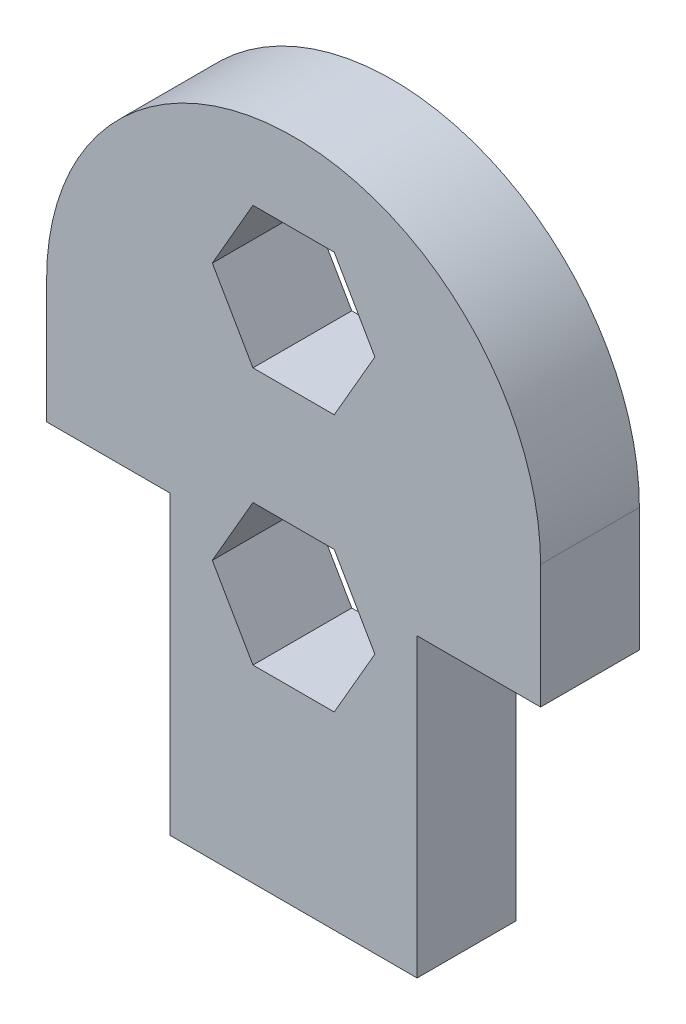
ISO-10303-21;
HEADER;
FILE_DESCRIPTION(('STEP AP214'),'2;1');
FILE_NAME('part.step','',(''),(''),'','','');
FILE_SCHEMA(('AUTOMOTIVE_DESIGN { 1 0 10303 214 1 1 1 1 }'));
ENDSEC;
DATA;
#1=APPLICATION_CONTEXT('core data for automotive mechanical design processes');
#2=APPLICATION_PROTOCOL_DEFINITION('international standard','automotive_design',2000,#1);
#3=PRODUCT_CONTEXT('',#1,'mechanical');
#4=PRODUCT('Part','Part','',(#3));
#5=PRODUCT_RELATED_PRODUCT_CATEGORY('part','',(#4));
#6=PRODUCT_DEFINITION_FORMATION('','',#4);
#7=PRODUCT_DEFINITION_CONTEXT('part definition',#1,'design');
#8=PRODUCT_DEFINITION('design','',#6,#7);
#9=PRODUCT_DEFINITION_SHAPE('','',#8);
#10=(LENGTH_UNIT() NAMED_UNIT(*) SI_UNIT(.MILLI.,.METRE.));
#11=(NAMED_UNIT(*) PLANE_ANGLE_UNIT() SI_UNIT($,.RADIAN.));
#12=(NAMED_UNIT(*) SI_UNIT($,.STERADIAN.) SOLID_ANGLE_UNIT());
#13=UNCERTAINTY_MEASURE_WITH_UNIT(LENGTH_MEASURE(1.E-05),#10,'distance_accuracy_value','');
#14=(GEOMETRIC_REPRESENTATION_CONTEXT(3) GLOBAL_UNCERTAINTY_ASSIGNED_CONTEXT((#13)) GLOBAL_UNIT_ASSIGNED_CONTEXT((#10,
#11,#12)) REPRESENTATION_CONTEXT('',''));
#15=CARTESIAN_POINT('',(0.,0.,0.));
#16=DIRECTION('',(0.,0.,1.));
#17=DIRECTION('',(1.,0.,0.));
#18=AXIS2_PLACEMENT_3D('',#15,#16,#17);
#19=CARTESIAN_POINT('',(5.,17.,4.));
#20=DIRECTION('',(0.,0.,1.));
#21=DIRECTION('',(1.,0.,0.));
#22=AXIS2_PLACEMENT_3D('',#19,#20,#21);
#23=PLANE('',#22);
#24=DIRECTION('',(0.,1.,0.));
#25=VECTOR('',#24,1.);
#26=CARTESIAN_POINT('',(10.,0.,4.));
#27=LINE('',#26,#25);
#28=CARTESIAN_POINT('',(10.,0.,4.));
#29=VERTEX_POINT('',#28);
#30=CARTESIAN_POINT('',(10.,12.,4.));
#31=VERTEX_POINT('',#30);
#32=EDGE_CURVE('E274',#29,#31,#27,.T.);
#33=ORIENTED_EDGE('',*,*,#32,.T.);
#34=DIRECTION('',(1.,0.,0.));
#35=VECTOR('',#34,1.);
#36=CARTESIAN_POINT('',(10.,12.,4.));
#37=LINE('',#36,#35);
#38=CARTESIAN_POINT('',(15.,12.,4.));
#39=VERTEX_POINT('',#38);
#40=EDGE_CURVE('E276',#31,#39,#37,.T.);
#41=ORIENTED_EDGE('',*,*,#40,.T.);
#42=DIRECTION('',(0.,1.,0.));
#43=VECTOR('',#42,1.);
#44=CARTESIAN_POINT('',(15.,12.,4.));
#45=LINE('',#44,#43);
#46=CARTESIAN_POINT('',(15.,17.,4.));
#47=VERTEX_POINT('',#46);
#48=EDGE_CURVE('E278',#39,#47,#45,.T.);
#49=ORIENTED_EDGE('',*,*,#48,.T.);
#50=CARTESIAN_POINT('',(5.,17.,4.));
#51=DIRECTION('',(0.,0.,1.));
#52=DIRECTION('',(1.,0.,0.));
#53=AXIS2_PLACEMENT_3D('',#50,#51,#52);
#54=CIRCLE('',#53,10.);
#55=CARTESIAN_POINT('',(-5.,17.,4.));
#56=VERTEX_POINT('',#55);
#57=EDGE_CURVE('E280',#47,#56,#54,.T.);
#58=ORIENTED_EDGE('',*,*,#57,.T.);
#59=DIRECTION('',(0.,-1.,0.));
#60=VECTOR('',#59,1.);
#61=CARTESIAN_POINT('',(-5.,12.,4.));
#62=LINE('',#61,#60);
#63=CARTESIAN_POINT('',(-5.,12.,4.));
#64=VERTEX_POINT('',#63);
#65=EDGE_CURVE('E282',#56,#64,#62,.T.);
#66=ORIENTED_EDGE('',*,*,#65,.T.);
#67=DIRECTION('',(1.,0.,0.));
#68=VECTOR('',#67,1.);
#69=CARTESIAN_POINT('',(0.,12.,4.));
#70=LINE('',#69,#68);
#71=CARTESIAN_POINT('',(0.,12.,4.));
#72=VERTEX_POINT('',#71);
#73=EDGE_CURVE('E284',#64,#72,#70,.T.);
#74=ORIENTED_EDGE('',*,*,#73,.T.);
#75=DIRECTION('',(0.,-1.,0.));
#76=VECTOR('',#75,1.);
#77=CARTESIAN_POINT('',(0.,0.,4.));
#78=LINE('',#77,#76);
#79=CARTESIAN_POINT('',(0.,0.,4.));
#80=VERTEX_POINT('',#79);
#81=EDGE_CURVE('E268',#72,#80,#78,.T.);
#82=ORIENTED_EDGE('',*,*,#81,.T.);
#83=DIRECTION('',(1.,0.,0.));
#84=VECTOR('',#83,1.);
#85=CARTESIAN_POINT('',(0.,0.,4.));
#86=LINE('',#85,#84);
#87=EDGE_CURVE('E271',#80,#29,#86,.T.);
#88=ORIENTED_EDGE('',*,*,#87,.T.);
#89=EDGE_LOOP('',(#33,#41,#49,#58,#66,#74,#82,#88));
#90=FACE_BOUND('',#89,.T.);
#91=DIRECTION('',(-0.5,-0.866025403784439,0.));
#92=VECTOR('',#91,1.);
#93=CARTESIAN_POINT('',(3.35455173280957,23.7711723588727,4.));
#94=LINE('',#93,#92);
#95=CARTESIAN_POINT('',(3.35455173280957,23.7711723588727,4.));
#96=VERTEX_POINT('',#95);
#97=CARTESIAN_POINT('',(1.70910346561913,20.9211723588727,4.));
#98=VERTEX_POINT('',#97);
#99=EDGE_CURVE('E225',#96,#98,#94,.T.);
#100=ORIENTED_EDGE('',*,*,#99,.F.);
#101=DIRECTION('',(-1.,0.,0.));
#102=VECTOR('',#101,1.);
#103=CARTESIAN_POINT('',(6.64544826719043,23.7711723588727,4.));
#104=LINE('',#103,#102);
#105=CARTESIAN_POINT('',(6.64544826719043,23.7711723588727,4.));
#106=VERTEX_POINT('',#105);
#107=EDGE_CURVE('E223',#106,#96,#104,.T.);
#108=ORIENTED_EDGE('',*,*,#107,.F.);
#109=DIRECTION('',(-0.5,0.866025403784438,0.));
#110=VECTOR('',#109,1.);
#111=CARTESIAN_POINT('',(8.29089653438087,20.9211723588727,4.));
#112=LINE('',#111,#110);
#113=CARTESIAN_POINT('',(8.29089653438087,20.9211723588727,4.));
#114=VERTEX_POINT('',#113);
#115=EDGE_CURVE('E235',#114,#106,#112,.T.);
#116=ORIENTED_EDGE('',*,*,#115,.F.);
#117=DIRECTION('',(0.499999999999999,0.866025403784439,0.));
#118=VECTOR('',#117,1.);
#119=CARTESIAN_POINT('',(6.64544826719044,18.0711723588727,4.));
#120=LINE('',#119,#118);
#121=CARTESIAN_POINT('',(6.64544826719044,18.0711723588727,4.));
#122=VERTEX_POINT('',#121);
#123=EDGE_CURVE('E232',#122,#114,#120,.T.);
#124=ORIENTED_EDGE('',*,*,#123,.F.);
#125=DIRECTION('',(1.,0.,0.));
#126=VECTOR('',#125,1.);
#127=CARTESIAN_POINT('',(3.35455173280957,18.0711723588727,4.));
#128=LINE('',#127,#126);
#129=CARTESIAN_POINT('',(3.35455173280957,18.0711723588727,4.));
#130=VERTEX_POINT('',#129);
#131=EDGE_CURVE('E230',#130,#122,#128,.T.);
#132=ORIENTED_EDGE('',*,*,#131,.F.);
#133=DIRECTION('',(0.499999999999999,-0.866025403784439,0.));
#134=VECTOR('',#133,1.);
#135=CARTESIAN_POINT('',(1.70910346561913,20.9211723588727,4.));
#136=LINE('',#135,#134);
#137=EDGE_CURVE('E228',#98,#130,#136,.T.);
#138=ORIENTED_EDGE('',*,*,#137,.F.);
#139=EDGE_LOOP('',(#100,#108,#116,#124,#132,#138));
#140=FACE_BOUND('',#139,.T.);
#141=DIRECTION('',(-0.5,-0.866025403784439,0.));
#142=VECTOR('',#141,1.);
#143=CARTESIAN_POINT('',(3.35455173280957,13.35,4.));
#144=LINE('',#143,#142);
#145=CARTESIAN_POINT('',(3.35455173280957,13.35,4.));
#146=VERTEX_POINT('',#145);
#147=CARTESIAN_POINT('',(1.70910346561913,10.5,4.));
#148=VERTEX_POINT('',#147);
#149=EDGE_CURVE('E180',#146,#148,#144,.T.);
#150=ORIENTED_EDGE('',*,*,#149,.F.);
#151=DIRECTION('',(-1.,0.,0.));
#152=VECTOR('',#151,1.);
#153=CARTESIAN_POINT('',(6.64544826719043,13.35,4.));
#154=LINE('',#153,#152);
#155=CARTESIAN_POINT('',(6.64544826719043,13.35,4.));
#156=VERTEX_POINT('',#155);
#157=EDGE_CURVE('E172',#156,#146,#154,.T.);
#158=ORIENTED_EDGE('',*,*,#157,.F.);
#159=DIRECTION('',(-0.5,0.866025403784439,0.));
#160=VECTOR('',#159,1.);
#161=CARTESIAN_POINT('',(8.29089653438087,10.5,4.));
#162=LINE('',#161,#160);
#163=CARTESIAN_POINT('',(8.29089653438087,10.5,4.));
#164=VERTEX_POINT('',#163);
#165=EDGE_CURVE('E201',#164,#156,#162,.T.);
#166=ORIENTED_EDGE('',*,*,#165,.F.);
#167=DIRECTION('',(0.5,0.866025403784439,0.));
#168=VECTOR('',#167,1.);
#169=CARTESIAN_POINT('',(6.64544826719043,7.65,4.));
#170=LINE('',#169,#168);
#171=CARTESIAN_POINT('',(6.64544826719043,7.65,4.));
#172=VERTEX_POINT('',#171);
#173=EDGE_CURVE('E199',#172,#164,#170,.T.);
#174=ORIENTED_EDGE('',*,*,#173,.F.);
#175=DIRECTION('',(1.,0.,0.));
#176=VECTOR('',#175,1.);
#177=CARTESIAN_POINT('',(3.35455173280956,7.65,4.));
#178=LINE('',#177,#176);
#179=CARTESIAN_POINT('',(3.35455173280956,7.65,4.));
#180=VERTEX_POINT('',#179);
#181=EDGE_CURVE('E195',#180,#172,#178,.T.);
#182=ORIENTED_EDGE('',*,*,#181,.F.);
#183=DIRECTION('',(0.499999999999999,-0.866025403784439,0.));
#184=VECTOR('',#183,1.);
#185=CARTESIAN_POINT('',(1.70910346561913,10.5,4.));
#186=LINE('',#185,#184);
#187=EDGE_CURVE('E193',#148,#180,#186,.T.);
#188=ORIENTED_EDGE('',*,*,#187,.F.);
#189=EDGE_LOOP('',(#150,#158,#166,#174,#182,#188));
#190=FACE_BOUND('',#189,.T.);
#191=ADVANCED_FACE('F35',(#90,#140,#190),#23,.T.);
#192=CARTESIAN_POINT('',(5.,17.,0.));
#193=DIRECTION('',(0.,0.,1.));
#194=DIRECTION('',(1.,0.,0.));
#195=AXIS2_PLACEMENT_3D('',#192,#193,#194);
#196=PLANE('',#195);
#197=DIRECTION('',(-1.,0.,0.));
#198=VECTOR('',#197,1.);
#199=CARTESIAN_POINT('',(6.64544826719043,23.7711723588727,0.));
#200=LINE('',#199,#198);
#201=CARTESIAN_POINT('',(6.64544826719043,23.7711723588727,0.));
#202=VERTEX_POINT('',#201);
#203=CARTESIAN_POINT('',(3.35455173280957,23.7711723588727,0.));
#204=VERTEX_POINT('',#203);
#205=EDGE_CURVE('E188',#202,#204,#200,.T.);
#206=ORIENTED_EDGE('',*,*,#205,.T.);
#207=DIRECTION('',(-0.5,-0.866025403784439,0.));
#208=VECTOR('',#207,1.);
#209=CARTESIAN_POINT('',(3.35455173280957,23.7711723588727,0.));
#210=LINE('',#209,#208);
#211=CARTESIAN_POINT('',(1.70910346561913,20.9211723588727,0.));
#212=VERTEX_POINT('',#211);
#213=EDGE_CURVE('E240',#204,#212,#210,.T.);
#214=ORIENTED_EDGE('',*,*,#213,.T.);
#215=DIRECTION('',(0.499999999999999,-0.866025403784439,0.));
#216=VECTOR('',#215,1.);
#217=CARTESIAN_POINT('',(1.70910346561913,20.9211723588727,0.));
#218=LINE('',#217,#216);
#219=CARTESIAN_POINT('',(3.35455173280957,18.0711723588727,0.));
#220=VERTEX_POINT('',#219);
#221=EDGE_CURVE('E243',#212,#220,#218,.T.);
#222=ORIENTED_EDGE('',*,*,#221,.T.);
#223=DIRECTION('',(1.,0.,0.));
#224=VECTOR('',#223,1.);
#225=CARTESIAN_POINT('',(3.35455173280957,18.0711723588727,0.));
#226=LINE('',#225,#224);
#227=CARTESIAN_POINT('',(6.64544826719044,18.0711723588727,0.));
#228=VERTEX_POINT('',#227);
#229=EDGE_CURVE('E246',#220,#228,#226,.T.);
#230=ORIENTED_EDGE('',*,*,#229,.T.);
#231=DIRECTION('',(0.499999999999999,0.866025403784439,0.));
#232=VECTOR('',#231,1.);
#233=CARTESIAN_POINT('',(6.64544826719044,18.0711723588727,0.));
#234=LINE('',#233,#232);
#235=CARTESIAN_POINT('',(8.29089653438087,20.9211723588727,0.));
#236=VERTEX_POINT('',#235);
#237=EDGE_CURVE('E249',#228,#236,#234,.T.);
#238=ORIENTED_EDGE('',*,*,#237,.T.);
#239=DIRECTION('',(-0.5,0.866025403784438,0.));
#240=VECTOR('',#239,1.);
#241=CARTESIAN_POINT('',(8.29089653438087,20.9211723588727,0.));
#242=LINE('',#241,#240);
#243=EDGE_CURVE('E226',#236,#202,#242,.T.);
#244=ORIENTED_EDGE('',*,*,#243,.T.);
#245=EDGE_LOOP('',(#206,#214,#222,#230,#238,#244));
#246=FACE_BOUND('',#245,.T.);
#247=DIRECTION('',(0.,1.,0.));
#248=VECTOR('',#247,1.);
#249=CARTESIAN_POINT('',(10.,8.,0.));
#250=LINE('',#249,#248);
#251=CARTESIAN_POINT('',(10.,0.,0.));
#252=VERTEX_POINT('',#251);
#253=CARTESIAN_POINT('',(10.,12.,0.));
#254=VERTEX_POINT('',#253);
#255=EDGE_CURVE('E290',#252,#254,#250,.T.);
#256=ORIENTED_EDGE('',*,*,#255,.F.);
#257=DIRECTION('',(1.,0.,0.));
#258=VECTOR('',#257,1.);
#259=CARTESIAN_POINT('',(0.,0.,0.));
#260=LINE('',#259,#258);
#261=CARTESIAN_POINT('',(0.,0.,0.));
#262=VERTEX_POINT('',#261);
#263=EDGE_CURVE('E267',#262,#252,#260,.T.);
#264=ORIENTED_EDGE('',*,*,#263,.F.);
#265=DIRECTION('',(0.,-1.,0.));
#266=VECTOR('',#265,1.);
#267=CARTESIAN_POINT('',(0.,8.,0.));
#268=LINE('',#267,#266);
#269=CARTESIAN_POINT('',(0.,12.,0.));
#270=VERTEX_POINT('',#269);
#271=EDGE_CURVE('E272',#270,#262,#268,.T.);
#272=ORIENTED_EDGE('',*,*,#271,.F.);
#273=DIRECTION('',(1.,0.,0.));
#274=VECTOR('',#273,1.);
#275=CARTESIAN_POINT('',(0.,12.,0.));
#276=LINE('',#275,#274);
#277=CARTESIAN_POINT('',(-5.,12.,0.));
#278=VERTEX_POINT('',#277);
#279=EDGE_CURVE('E300',#278,#270,#276,.T.);
#280=ORIENTED_EDGE('',*,*,#279,.F.);
#281=DIRECTION('',(0.,-1.,0.));
#282=VECTOR('',#281,1.);
#283=CARTESIAN_POINT('',(-5.,12.,0.));
#284=LINE('',#283,#282);
#285=CARTESIAN_POINT('',(-5.,17.,0.));
#286=VERTEX_POINT('',#285);
#287=EDGE_CURVE('E298',#286,#278,#284,.T.);
#288=ORIENTED_EDGE('',*,*,#287,.F.);
#289=CARTESIAN_POINT('',(5.,17.,0.));
#290=DIRECTION('',(0.,0.,1.));
#291=DIRECTION('',(1.,0.,0.));
#292=AXIS2_PLACEMENT_3D('',#289,#290,#291);
#293=CIRCLE('',#292,10.);
#294=CARTESIAN_POINT('',(15.,17.,0.));
#295=VERTEX_POINT('',#294);
#296=EDGE_CURVE('E296',#295,#286,#293,.T.);
#297=ORIENTED_EDGE('',*,*,#296,.F.);
#298=DIRECTION('',(0.,1.,0.));
#299=VECTOR('',#298,1.);
#300=CARTESIAN_POINT('',(15.,12.,0.));
#301=LINE('',#300,#299);
#302=CARTESIAN_POINT('',(15.,12.,0.));
#303=VERTEX_POINT('',#302);
#304=EDGE_CURVE('E294',#303,#295,#301,.T.);
#305=ORIENTED_EDGE('',*,*,#304,.F.);
#306=DIRECTION('',(1.,0.,0.));
#307=VECTOR('',#306,1.);
#308=CARTESIAN_POINT('',(10.,12.,0.));
#309=LINE('',#308,#307);
#310=EDGE_CURVE('E292',#254,#303,#309,.T.);
#311=ORIENTED_EDGE('',*,*,#310,.F.);
#312=EDGE_LOOP('',(#256,#264,#272,#280,#288,#297,#305,#311));
#313=FACE_BOUND('',#312,.T.);
#314=DIRECTION('',(-1.,0.,0.));
#315=VECTOR('',#314,1.);
#316=CARTESIAN_POINT('',(6.64544826719043,13.35,0.));
#317=LINE('',#316,#315);
#318=CARTESIAN_POINT('',(6.64544826719043,13.35,0.));
#319=VERTEX_POINT('',#318);
#320=CARTESIAN_POINT('',(3.35455173280957,13.35,0.));
#321=VERTEX_POINT('',#320);
#322=EDGE_CURVE('E58',#319,#321,#317,.T.);
#323=ORIENTED_EDGE('',*,*,#322,.T.);
#324=DIRECTION('',(-0.5,-0.866025403784439,0.));
#325=VECTOR('',#324,1.);
#326=CARTESIAN_POINT('',(3.35455173280957,13.35,0.));
#327=LINE('',#326,#325);
#328=CARTESIAN_POINT('',(1.70910346561913,10.5,0.));
#329=VERTEX_POINT('',#328);
#330=EDGE_CURVE('E187',#321,#329,#327,.T.);
#331=ORIENTED_EDGE('',*,*,#330,.T.);
#332=DIRECTION('',(0.499999999999999,-0.866025403784439,0.));
#333=VECTOR('',#332,1.);
#334=CARTESIAN_POINT('',(1.70910346561913,10.5,0.));
#335=LINE('',#334,#333);
#336=CARTESIAN_POINT('',(3.35455173280956,7.65,0.));
#337=VERTEX_POINT('',#336);
#338=EDGE_CURVE('E205',#329,#337,#335,.T.);
#339=ORIENTED_EDGE('',*,*,#338,.T.);
#340=DIRECTION('',(1.,0.,0.));
#341=VECTOR('',#340,1.);
#342=CARTESIAN_POINT('',(3.35455173280956,7.65,0.));
#343=LINE('',#342,#341);
#344=CARTESIAN_POINT('',(6.64544826719043,7.65,0.));
#345=VERTEX_POINT('',#344);
#346=EDGE_CURVE('E208',#337,#345,#343,.T.);
#347=ORIENTED_EDGE('',*,*,#346,.T.);
#348=DIRECTION('',(0.5,0.866025403784439,0.));
#349=VECTOR('',#348,1.);
#350=CARTESIAN_POINT('',(6.64544826719043,7.65,0.));
#351=LINE('',#350,#349);
#352=CARTESIAN_POINT('',(8.29089653438087,10.5,0.));
#353=VERTEX_POINT('',#352);
#354=EDGE_CURVE('E211',#345,#353,#351,.T.);
#355=ORIENTED_EDGE('',*,*,#354,.T.);
#356=DIRECTION('',(-0.5,0.866025403784439,0.));
#357=VECTOR('',#356,1.);
#358=CARTESIAN_POINT('',(8.29089653438087,10.5,0.));
#359=LINE('',#358,#357);
#360=EDGE_CURVE('E181',#353,#319,#359,.T.);
#361=ORIENTED_EDGE('',*,*,#360,.T.);
#362=EDGE_LOOP('',(#323,#331,#339,#347,#355,#361));
#363=FACE_BOUND('',#362,.T.);
#364=ADVANCED_FACE('F330',(#246,#313,#363),#196,.F.);
#365=CARTESIAN_POINT('',(0.,0.,4.));
#366=DIRECTION('',(0.,1.,0.));
#367=DIRECTION('',(0.,0.,1.));
#368=AXIS2_PLACEMENT_3D('',#365,#366,#367);
#369=PLANE('',#368);
#370=ORIENTED_EDGE('',*,*,#263,.T.);
#371=DIRECTION('',(0.,0.,-1.));
#372=VECTOR('',#371,1.);
#373=CARTESIAN_POINT('',(10.,0.,4.));
#374=LINE('',#373,#372);
#375=EDGE_CURVE('E43',#29,#252,#374,.T.);
#376=ORIENTED_EDGE('',*,*,#375,.F.);
#377=ORIENTED_EDGE('',*,*,#87,.F.);
#378=DIRECTION('',(0.,0.,-1.));
#379=VECTOR('',#378,1.);
#380=CARTESIAN_POINT('',(0.,0.,4.));
#381=LINE('',#380,#379);
#382=EDGE_CURVE('E11',#80,#262,#381,.T.);
#383=ORIENTED_EDGE('',*,*,#382,.T.);
#384=EDGE_LOOP('',(#370,#376,#377,#383));
#385=FACE_BOUND('',#384,.T.);
#386=ADVANCED_FACE('F37',(#385),#369,.F.);
#387=CARTESIAN_POINT('',(10.,8.,4.));
#388=DIRECTION('',(-1.,0.,0.));
#389=DIRECTION('',(0.,0.,1.));
#390=AXIS2_PLACEMENT_3D('',#387,#388,#389);
#391=PLANE('',#390);
#392=ORIENTED_EDGE('',*,*,#255,.T.);
#393=DIRECTION('',(0.,0.,-1.));
#394=VECTOR('',#393,1.);
#395=CARTESIAN_POINT('',(10.,12.,4.));
#396=LINE('',#395,#394);
#397=EDGE_CURVE('E317',#31,#254,#396,.T.);
#398=ORIENTED_EDGE('',*,*,#397,.F.);
#399=ORIENTED_EDGE('',*,*,#32,.F.);
#400=ORIENTED_EDGE('',*,*,#375,.T.);
#401=EDGE_LOOP('',(#392,#398,#399,#400));
#402=FACE_BOUND('',#401,.T.);
#403=ADVANCED_FACE('F323',(#402),#391,.F.);
#404=CARTESIAN_POINT('',(10.,12.,4.));
#405=DIRECTION('',(0.,1.,0.));
#406=DIRECTION('',(0.,0.,1.));
#407=AXIS2_PLACEMENT_3D('',#404,#405,#406);
#408=PLANE('',#407);
#409=ORIENTED_EDGE('',*,*,#310,.T.);
#410=DIRECTION('',(0.,0.,-1.));
#411=VECTOR('',#410,1.);
#412=CARTESIAN_POINT('',(15.,12.,4.));
#413=LINE('',#412,#411);
#414=EDGE_CURVE('E314',#39,#303,#413,.T.);
#415=ORIENTED_EDGE('',*,*,#414,.F.);
#416=ORIENTED_EDGE('',*,*,#40,.F.);
#417=ORIENTED_EDGE('',*,*,#397,.T.);
#418=EDGE_LOOP('',(#409,#415,#416,#417));
#419=FACE_BOUND('',#418,.T.);
#420=ADVANCED_FACE('F338',(#419),#408,.F.);
#421=CARTESIAN_POINT('',(15.,12.,4.));
#422=DIRECTION('',(-1.,0.,0.));
#423=DIRECTION('',(0.,-1.,0.));
#424=AXIS2_PLACEMENT_3D('',#421,#422,#423);
#425=PLANE('',#424);
#426=ORIENTED_EDGE('',*,*,#304,.T.);
#427=DIRECTION('',(0.,0.,-1.));
#428=VECTOR('',#427,1.);
#429=CARTESIAN_POINT('',(15.,17.,4.));
#430=LINE('',#429,#428);
#431=EDGE_CURVE('E311',#47,#295,#430,.T.);
#432=ORIENTED_EDGE('',*,*,#431,.F.);
#433=ORIENTED_EDGE('',*,*,#48,.F.);
#434=ORIENTED_EDGE('',*,*,#414,.T.);
#435=EDGE_LOOP('',(#426,#432,#433,#434));
#436=FACE_BOUND('',#435,.T.);
#437=ADVANCED_FACE('F342',(#436),#425,.F.);
#438=CARTESIAN_POINT('',(5.,17.,4.));
#439=DIRECTION('',(0.,0.,-1.));
#440=DIRECTION('',(-1.,0.,0.));
#441=AXIS2_PLACEMENT_3D('',#438,#439,#440);
#442=CYLINDRICAL_SURFACE('',#441,10.);
#443=ORIENTED_EDGE('',*,*,#296,.T.);
#444=DIRECTION('',(0.,0.,-1.));
#445=VECTOR('',#444,1.);
#446=CARTESIAN_POINT('',(-5.,17.,4.));
#447=LINE('',#446,#445);
#448=EDGE_CURVE('E308',#56,#286,#447,.T.);
#449=ORIENTED_EDGE('',*,*,#448,.F.);
#450=ORIENTED_EDGE('',*,*,#57,.F.);
#451=ORIENTED_EDGE('',*,*,#431,.T.);
#452=EDGE_LOOP('',(#443,#449,#450,#451));
#453=FACE_BOUND('',#452,.T.);
#454=ADVANCED_FACE('F360',(#453),#442,.T.);
#455=CARTESIAN_POINT('',(-5.,12.,4.));
#456=DIRECTION('',(1.,0.,0.));
#457=DIRECTION('',(0.,1.,0.));
#458=AXIS2_PLACEMENT_3D('',#455,#456,#457);
#459=PLANE('',#458);
#460=ORIENTED_EDGE('',*,*,#287,.T.);
#461=DIRECTION('',(0.,0.,-1.));
#462=VECTOR('',#461,1.);
#463=CARTESIAN_POINT('',(-5.,12.,4.));
#464=LINE('',#463,#462);
#465=EDGE_CURVE('E305',#64,#278,#464,.T.);
#466=ORIENTED_EDGE('',*,*,#465,.F.);
#467=ORIENTED_EDGE('',*,*,#65,.F.);
#468=ORIENTED_EDGE('',*,*,#448,.T.);
#469=EDGE_LOOP('',(#460,#466,#467,#468));
#470=FACE_BOUND('',#469,.T.);
#471=ADVANCED_FACE('F357',(#470),#459,.F.);
#472=CARTESIAN_POINT('',(0.,12.,4.));
#473=DIRECTION('',(0.,1.,0.));
#474=DIRECTION('',(0.,0.,1.));
#475=AXIS2_PLACEMENT_3D('',#472,#473,#474);
#476=PLANE('',#475);
#477=ORIENTED_EDGE('',*,*,#279,.T.);
#478=DIRECTION('',(0.,0.,-1.));
#479=VECTOR('',#478,1.);
#480=CARTESIAN_POINT('',(0.,12.,4.));
#481=LINE('',#480,#479);
#482=EDGE_CURVE('E287',#72,#270,#481,.T.);
#483=ORIENTED_EDGE('',*,*,#482,.F.);
#484=ORIENTED_EDGE('',*,*,#73,.F.);
#485=ORIENTED_EDGE('',*,*,#465,.T.);
#486=EDGE_LOOP('',(#477,#483,#484,#485));
#487=FACE_BOUND('',#486,.T.);
#488=ADVANCED_FACE('F353',(#487),#476,.F.);
#489=CARTESIAN_POINT('',(0.,8.,4.));
#490=DIRECTION('',(1.,0.,0.));
#491=DIRECTION('',(0.,0.,-1.));
#492=AXIS2_PLACEMENT_3D('',#489,#490,#491);
#493=PLANE('',#492);
#494=ORIENTED_EDGE('',*,*,#271,.T.);
#495=ORIENTED_EDGE('',*,*,#382,.F.);
#496=ORIENTED_EDGE('',*,*,#81,.F.);
#497=ORIENTED_EDGE('',*,*,#482,.T.);
#498=EDGE_LOOP('',(#494,#495,#496,#497));
#499=FACE_BOUND('',#498,.T.);
#500=ADVANCED_FACE('F351',(#499),#493,.F.);
#501=CARTESIAN_POINT('',(6.64544826719043,23.7711723588727,4.));
#502=DIRECTION('',(0.,-1.,0.));
#503=DIRECTION('',(0.,0.,-1.));
#504=AXIS2_PLACEMENT_3D('',#501,#502,#503);
#505=PLANE('',#504);
#506=ORIENTED_EDGE('',*,*,#205,.F.);
#507=DIRECTION('',(0.,0.,-1.));
#508=VECTOR('',#507,1.);
#509=CARTESIAN_POINT('',(6.64544826719043,23.7711723588727,4.));
#510=LINE('',#509,#508);
#511=EDGE_CURVE('E237',#106,#202,#510,.T.);
#512=ORIENTED_EDGE('',*,*,#511,.F.);
#513=ORIENTED_EDGE('',*,*,#107,.T.);
#514=DIRECTION('',(0.,0.,-1.));
#515=VECTOR('',#514,1.);
#516=CARTESIAN_POINT('',(3.35455173280957,23.7711723588727,4.));
#517=LINE('',#516,#515);
#518=EDGE_CURVE('E264',#96,#204,#517,.T.);
#519=ORIENTED_EDGE('',*,*,#518,.T.);
#520=EDGE_LOOP('',(#506,#512,#513,#519));
#521=FACE_BOUND('',#520,.T.);
#522=ADVANCED_FACE('F377',(#521),#505,.T.);
#523=CARTESIAN_POINT('',(3.35455173280957,23.7711723588727,4.));
#524=DIRECTION('',(0.866025403784439,-0.5,0.));
#525=DIRECTION('',(0.5,0.866025403784439,0.));
#526=AXIS2_PLACEMENT_3D('',#523,#524,#525);
#527=PLANE('',#526);
#528=ORIENTED_EDGE('',*,*,#213,.F.);
#529=ORIENTED_EDGE('',*,*,#518,.F.);
#530=ORIENTED_EDGE('',*,*,#99,.T.);
#531=DIRECTION('',(0.,0.,-1.));
#532=VECTOR('',#531,1.);
#533=CARTESIAN_POINT('',(1.70910346561913,20.9211723588727,4.));
#534=LINE('',#533,#532);
#535=EDGE_CURVE('E262',#98,#212,#534,.T.);
#536=ORIENTED_EDGE('',*,*,#535,.T.);
#537=EDGE_LOOP('',(#528,#529,#530,#536));
#538=FACE_BOUND('',#537,.T.);
#539=ADVANCED_FACE('F398',(#538),#527,.T.);
#540=CARTESIAN_POINT('',(1.70910346561913,20.9211723588727,4.));
#541=DIRECTION('',(0.866025403784439,0.5,0.));
#542=DIRECTION('',(-0.499999999999999,0.866025403784439,0.));
#543=AXIS2_PLACEMENT_3D('',#540,#541,#542);
#544=PLANE('',#543);
#545=ORIENTED_EDGE('',*,*,#221,.F.);
#546=ORIENTED_EDGE('',*,*,#535,.F.);
#547=ORIENTED_EDGE('',*,*,#137,.T.);
#548=DIRECTION('',(0.,0.,-1.));
#549=VECTOR('',#548,1.);
#550=CARTESIAN_POINT('',(3.35455173280957,18.0711723588727,4.));
#551=LINE('',#550,#549);
#552=EDGE_CURVE('E260',#130,#220,#551,.T.);
#553=ORIENTED_EDGE('',*,*,#552,.T.);
#554=EDGE_LOOP('',(#545,#546,#547,#553));
#555=FACE_BOUND('',#554,.T.);
#556=ADVANCED_FACE('F405',(#555),#544,.T.);
#557=CARTESIAN_POINT('',(3.35455173280957,18.0711723588727,4.));
#558=DIRECTION('',(0.,1.,0.));
#559=DIRECTION('',(-1.,0.,0.));
#560=AXIS2_PLACEMENT_3D('',#557,#558,#559);
#561=PLANE('',#560);
#562=ORIENTED_EDGE('',*,*,#229,.F.);
#563=ORIENTED_EDGE('',*,*,#552,.F.);
#564=ORIENTED_EDGE('',*,*,#131,.T.);
#565=DIRECTION('',(0.,0.,-1.));
#566=VECTOR('',#565,1.);
#567=CARTESIAN_POINT('',(6.64544826719044,18.0711723588727,4.));
#568=LINE('',#567,#566);
#569=EDGE_CURVE('E258',#122,#228,#568,.T.);
#570=ORIENTED_EDGE('',*,*,#569,.T.);
#571=EDGE_LOOP('',(#562,#563,#564,#570));
#572=FACE_BOUND('',#571,.T.);
#573=ADVANCED_FACE('F412',(#572),#561,.T.);
#574=CARTESIAN_POINT('',(6.64544826719044,18.0711723588727,4.));
#575=DIRECTION('',(-0.866025403784439,0.499999999999999,0.));
#576=DIRECTION('',(-0.499999999999999,-0.866025403784439,0.));
#577=AXIS2_PLACEMENT_3D('',#574,#575,#576);
#578=PLANE('',#577);
#579=ORIENTED_EDGE('',*,*,#237,.F.);
#580=ORIENTED_EDGE('',*,*,#569,.F.);
#581=ORIENTED_EDGE('',*,*,#123,.T.);
#582=DIRECTION('',(0.,0.,-1.));
#583=VECTOR('',#582,1.);
#584=CARTESIAN_POINT('',(8.29089653438087,20.9211723588727,4.));
#585=LINE('',#584,#583);
#586=EDGE_CURVE('E256',#114,#236,#585,.T.);
#587=ORIENTED_EDGE('',*,*,#586,.T.);
#588=EDGE_LOOP('',(#579,#580,#581,#587));
#589=FACE_BOUND('',#588,.T.);
#590=ADVANCED_FACE('F420',(#589),#578,.T.);
#591=CARTESIAN_POINT('',(8.29089653438087,20.9211723588727,4.));
#592=DIRECTION('',(-0.866025403784438,-0.5,0.));
#593=DIRECTION('',(0.5,-0.866025403784438,0.));
#594=AXIS2_PLACEMENT_3D('',#591,#592,#593);
#595=PLANE('',#594);
#596=ORIENTED_EDGE('',*,*,#243,.F.);
#597=ORIENTED_EDGE('',*,*,#586,.F.);
#598=ORIENTED_EDGE('',*,*,#115,.T.);
#599=ORIENTED_EDGE('',*,*,#511,.T.);
#600=EDGE_LOOP('',(#596,#597,#598,#599));
#601=FACE_BOUND('',#600,.T.);
#602=ADVANCED_FACE('F428',(#601),#595,.T.);
#603=CARTESIAN_POINT('',(6.64544826719043,13.35,4.));
#604=DIRECTION('',(0.,-1.,0.));
#605=DIRECTION('',(0.,0.,-1.));
#606=AXIS2_PLACEMENT_3D('',#603,#604,#605);
#607=PLANE('',#606);
#608=ORIENTED_EDGE('',*,*,#322,.F.);
#609=DIRECTION('',(0.,0.,-1.));
#610=VECTOR('',#609,1.);
#611=CARTESIAN_POINT('',(6.64544826719043,13.35,4.));
#612=LINE('',#611,#610);
#613=EDGE_CURVE('E176',#156,#319,#612,.T.);
#614=ORIENTED_EDGE('',*,*,#613,.F.);
#615=ORIENTED_EDGE('',*,*,#157,.T.);
#616=DIRECTION('',(0.,0.,-1.));
#617=VECTOR('',#616,1.);
#618=CARTESIAN_POINT('',(3.35455173280957,13.35,4.));
#619=LINE('',#618,#617);
#620=EDGE_CURVE('E175',#146,#321,#619,.T.);
#621=ORIENTED_EDGE('',*,*,#620,.T.);
#622=EDGE_LOOP('',(#608,#614,#615,#621));
#623=FACE_BOUND('',#622,.T.);
#624=ADVANCED_FACE('F174',(#623),#607,.T.);
#625=CARTESIAN_POINT('',(3.35455173280957,13.35,4.));
#626=DIRECTION('',(0.866025403784439,-0.5,0.));
#627=DIRECTION('',(0.5,0.866025403784439,0.));
#628=AXIS2_PLACEMENT_3D('',#625,#626,#627);
#629=PLANE('',#628);
#630=ORIENTED_EDGE('',*,*,#330,.F.);
#631=ORIENTED_EDGE('',*,*,#620,.F.);
#632=ORIENTED_EDGE('',*,*,#149,.T.);
#633=DIRECTION('',(0.,0.,-1.));
#634=VECTOR('',#633,1.);
#635=CARTESIAN_POINT('',(1.70910346561913,10.5,4.));
#636=LINE('',#635,#634);
#637=EDGE_CURVE('E189',#148,#329,#636,.T.);
#638=ORIENTED_EDGE('',*,*,#637,.T.);
#639=EDGE_LOOP('',(#630,#631,#632,#638));
#640=FACE_BOUND('',#639,.T.);
#641=ADVANCED_FACE('F184',(#640),#629,.T.);
#642=CARTESIAN_POINT('',(1.70910346561913,10.5,4.));
#643=DIRECTION('',(0.866025403784439,0.499999999999999,0.));
#644=DIRECTION('',(-0.499999999999999,0.866025403784439,0.));
#645=AXIS2_PLACEMENT_3D('',#642,#643,#644);
#646=PLANE('',#645);
#647=ORIENTED_EDGE('',*,*,#338,.F.);
#648=ORIENTED_EDGE('',*,*,#637,.F.);
#649=ORIENTED_EDGE('',*,*,#187,.T.);
#650=DIRECTION('',(0.,0.,-1.));
#651=VECTOR('',#650,1.);
#652=CARTESIAN_POINT('',(3.35455173280956,7.65,4.));
#653=LINE('',#652,#651);
#654=EDGE_CURVE('E220',#180,#337,#653,.T.);
#655=ORIENTED_EDGE('',*,*,#654,.T.);
#656=EDGE_LOOP('',(#647,#648,#649,#655));
#657=FACE_BOUND('',#656,.T.);
#658=ADVANCED_FACE('F449',(#657),#646,.T.);
#659=CARTESIAN_POINT('',(3.35455173280956,7.65,4.));
#660=DIRECTION('',(0.,1.,0.));
#661=DIRECTION('',(-1.,0.,0.));
#662=AXIS2_PLACEMENT_3D('',#659,#660,#661);
#663=PLANE('',#662);
#664=ORIENTED_EDGE('',*,*,#346,.F.);
#665=ORIENTED_EDGE('',*,*,#654,.F.);
#666=ORIENTED_EDGE('',*,*,#181,.T.);
#667=DIRECTION('',(0.,0.,-1.));
#668=VECTOR('',#667,1.);
#669=CARTESIAN_POINT('',(6.64544826719043,7.65,4.));
#670=LINE('',#669,#668);
#671=EDGE_CURVE('E218',#172,#345,#670,.T.);
#672=ORIENTED_EDGE('',*,*,#671,.T.);
#673=EDGE_LOOP('',(#664,#665,#666,#672));
#674=FACE_BOUND('',#673,.T.);
#675=ADVANCED_FACE('F456',(#674),#663,.T.);
#676=CARTESIAN_POINT('',(6.64544826719043,7.65,4.));
#677=DIRECTION('',(-0.866025403784439,0.5,0.));
#678=DIRECTION('',(-0.5,-0.866025403784439,0.));
#679=AXIS2_PLACEMENT_3D('',#676,#677,#678);
#680=PLANE('',#679);
#681=ORIENTED_EDGE('',*,*,#354,.F.);
#682=ORIENTED_EDGE('',*,*,#671,.F.);
#683=ORIENTED_EDGE('',*,*,#173,.T.);
#684=DIRECTION('',(0.,0.,-1.));
#685=VECTOR('',#684,1.);
#686=CARTESIAN_POINT('',(8.29089653438087,10.5,4.));
#687=LINE('',#686,#685);
#688=EDGE_CURVE('E50',#164,#353,#687,.T.);
#689=ORIENTED_EDGE('',*,*,#688,.T.);
#690=EDGE_LOOP('',(#681,#682,#683,#689));
#691=FACE_BOUND('',#690,.T.);
#692=ADVANCED_FACE('F464',(#691),#680,.T.);
#693=CARTESIAN_POINT('',(8.29089653438087,10.5,4.));
#694=DIRECTION('',(-0.866025403784439,-0.5,0.));
#695=DIRECTION('',(0.5,-0.866025403784439,0.));
#696=AXIS2_PLACEMENT_3D('',#693,#694,#695);
#697=PLANE('',#696);
#698=ORIENTED_EDGE('',*,*,#360,.F.);
#699=ORIENTED_EDGE('',*,*,#688,.F.);
#700=ORIENTED_EDGE('',*,*,#165,.T.);
#701=ORIENTED_EDGE('',*,*,#613,.T.);
#702=EDGE_LOOP('',(#698,#699,#700,#701));
#703=FACE_BOUND('',#702,.T.);
#704=ADVANCED_FACE('F472',(#703),#697,.T.);
#705=CLOSED_SHELL('',(#191,#364,#386,#403,#420,#437,#454,#471,#488,#500,#522,#539,#556,#573,
#590,#602,#624,#641,#658,#675,#692,#704));
#706=MANIFOLD_SOLID_BREP('B2',#705);
#707=ADVANCED_BREP_SHAPE_REPRESENTATION('',(#18,#706),#14);
#708=SHAPE_DEFINITION_REPRESENTATION(#9,#707);
ENDSEC;
END-ISO-10303-21;
